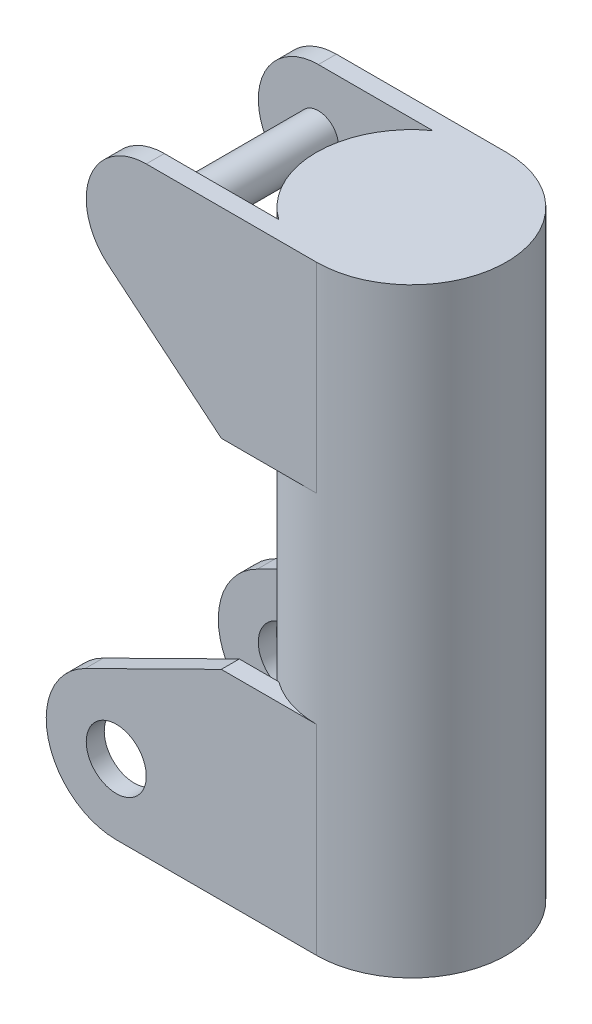
ISO-10303-21;
HEADER;
FILE_DESCRIPTION(('STEP AP214'),'2;1');
FILE_NAME('part.step','',(''),(''),'','','');
FILE_SCHEMA(('AUTOMOTIVE_DESIGN { 1 0 10303 214 1 1 1 1 }'));
ENDSEC;
DATA;
#1=APPLICATION_CONTEXT('core data for automotive mechanical design processes');
#2=APPLICATION_PROTOCOL_DEFINITION('international standard','automotive_design',2000,#1);
#3=PRODUCT_CONTEXT('',#1,'mechanical');
#4=PRODUCT('Part','Part','',(#3));
#5=PRODUCT_RELATED_PRODUCT_CATEGORY('part','',(#4));
#6=PRODUCT_DEFINITION_FORMATION('','',#4);
#7=PRODUCT_DEFINITION_CONTEXT('part definition',#1,'design');
#8=PRODUCT_DEFINITION('design','',#6,#7);
#9=PRODUCT_DEFINITION_SHAPE('','',#8);
#10=(LENGTH_UNIT() NAMED_UNIT(*) SI_UNIT(.MILLI.,.METRE.));
#11=(NAMED_UNIT(*) PLANE_ANGLE_UNIT() SI_UNIT($,.RADIAN.));
#12=(NAMED_UNIT(*) SI_UNIT($,.STERADIAN.) SOLID_ANGLE_UNIT());
#13=UNCERTAINTY_MEASURE_WITH_UNIT(LENGTH_MEASURE(1.E-05),#10,'distance_accuracy_value','');
#14=(GEOMETRIC_REPRESENTATION_CONTEXT(3) GLOBAL_UNCERTAINTY_ASSIGNED_CONTEXT((#13)) GLOBAL_UNIT_ASSIGNED_CONTEXT((#10,
#11,#12)) REPRESENTATION_CONTEXT('',''));
#15=CARTESIAN_POINT('',(0.,0.,0.));
#16=DIRECTION('',(0.,0.,1.));
#17=DIRECTION('',(1.,0.,0.));
#18=AXIS2_PLACEMENT_3D('',#15,#16,#17);
#19=CARTESIAN_POINT('',(0.,600.,0.));
#20=DIRECTION('',(0.,-1.,0.));
#21=DIRECTION('',(0.,0.,-1.));
#22=AXIS2_PLACEMENT_3D('',#19,#20,#21);
#23=CYLINDRICAL_SURFACE('',#22,95.);
#24=DIRECTION('',(0.,-1.,0.));
#25=VECTOR('',#24,1.);
#26=CARTESIAN_POINT('',(-55.6417109729742,600.,77.));
#27=LINE('',#26,#25);
#28=CARTESIAN_POINT('',(-55.6417109729742,200.,77.));
#29=VERTEX_POINT('',#28);
#30=CARTESIAN_POINT('',(-55.6417109729742,0.,77.));
#31=VERTEX_POINT('',#30);
#32=EDGE_CURVE('E341',#29,#31,#27,.T.);
#33=ORIENTED_EDGE('',*,*,#32,.F.);
#34=CARTESIAN_POINT('',(0.,200.,0.));
#35=DIRECTION('',(0.,-1.,0.));
#36=DIRECTION('',(0.,0.,-1.));
#37=AXIS2_PLACEMENT_3D('',#34,#35,#36);
#38=CIRCLE('',#37,95.);
#39=CARTESIAN_POINT('',(0.,200.,95.));
#40=VERTEX_POINT('',#39);
#41=EDGE_CURVE('E344',#40,#29,#38,.T.);
#42=ORIENTED_EDGE('',*,*,#41,.F.);
#43=DIRECTION('',(0.,-1.,0.));
#44=VECTOR('',#43,1.);
#45=CARTESIAN_POINT('',(0.,200.,95.));
#46=LINE('',#45,#44);
#47=CARTESIAN_POINT('',(0.,0.,95.));
#48=VERTEX_POINT('',#47);
#49=EDGE_CURVE('E297',#40,#48,#46,.T.);
#50=ORIENTED_EDGE('',*,*,#49,.T.);
#51=CARTESIAN_POINT('',(0.,0.,0.));
#52=DIRECTION('',(0.,1.,0.));
#53=DIRECTION('',(0.,0.,1.));
#54=AXIS2_PLACEMENT_3D('',#51,#52,#53);
#55=CIRCLE('',#54,95.);
#56=CARTESIAN_POINT('',(0.,0.,-95.));
#57=VERTEX_POINT('',#56);
#58=EDGE_CURVE('E452',#48,#57,#55,.T.);
#59=ORIENTED_EDGE('',*,*,#58,.T.);
#60=DIRECTION('',(0.,-1.,0.));
#61=VECTOR('',#60,1.);
#62=CARTESIAN_POINT('',(0.,200.,-95.));
#63=LINE('',#62,#61);
#64=CARTESIAN_POINT('',(0.,200.,-95.));
#65=VERTEX_POINT('',#64);
#66=EDGE_CURVE('E401',#65,#57,#63,.T.);
#67=ORIENTED_EDGE('',*,*,#66,.F.);
#68=CARTESIAN_POINT('',(0.,200.,0.));
#69=DIRECTION('',(0.,1.,0.));
#70=DIRECTION('',(0.,0.,1.));
#71=AXIS2_PLACEMENT_3D('',#68,#69,#70);
#72=CIRCLE('',#71,95.);
#73=CARTESIAN_POINT('',(-55.6417109729742,200.,-77.));
#74=VERTEX_POINT('',#73);
#75=EDGE_CURVE('E450',#65,#74,#72,.T.);
#76=ORIENTED_EDGE('',*,*,#75,.T.);
#77=DIRECTION('',(0.,-1.,0.));
#78=VECTOR('',#77,1.);
#79=CARTESIAN_POINT('',(-55.6417109729742,600.,-77.));
#80=LINE('',#79,#78);
#81=CARTESIAN_POINT('',(-55.6417109729742,0.,-77.));
#82=VERTEX_POINT('',#81);
#83=EDGE_CURVE('E445',#82,#74,#80,.F.);
#84=ORIENTED_EDGE('',*,*,#83,.F.);
#85=EDGE_CURVE('E456',#82,#31,#55,.T.);
#86=ORIENTED_EDGE('',*,*,#85,.T.);
#87=EDGE_LOOP('',(#33,#42,#50,#59,#67,#76,#84,#86));
#88=FACE_BOUND('',#87,.T.);
#89=DIRECTION('',(0.,-1.,0.));
#90=VECTOR('',#89,1.);
#91=CARTESIAN_POINT('',(-55.6417109729742,600.,77.));
#92=LINE('',#91,#90);
#93=CARTESIAN_POINT('',(-55.6417109729742,600.,77.));
#94=VERTEX_POINT('',#93);
#95=CARTESIAN_POINT('',(-55.6417109729742,400.,77.));
#96=VERTEX_POINT('',#95);
#97=EDGE_CURVE('E286',#94,#96,#92,.T.);
#98=ORIENTED_EDGE('',*,*,#97,.F.);
#99=CARTESIAN_POINT('',(0.,600.,0.));
#100=DIRECTION('',(0.,1.,0.));
#101=DIRECTION('',(0.,0.,1.));
#102=AXIS2_PLACEMENT_3D('',#99,#100,#101);
#103=CIRCLE('',#102,95.);
#104=CARTESIAN_POINT('',(-55.6417109729742,600.,-77.));
#105=VERTEX_POINT('',#104);
#106=EDGE_CURVE('E257',#105,#94,#103,.T.);
#107=ORIENTED_EDGE('',*,*,#106,.F.);
#108=DIRECTION('',(0.,-1.,0.));
#109=VECTOR('',#108,1.);
#110=CARTESIAN_POINT('',(-55.6417109729742,600.,-77.));
#111=LINE('',#110,#109);
#112=CARTESIAN_POINT('',(-55.6417109729742,400.,-77.));
#113=VERTEX_POINT('',#112);
#114=EDGE_CURVE('E389',#113,#105,#111,.F.);
#115=ORIENTED_EDGE('',*,*,#114,.F.);
#116=CARTESIAN_POINT('',(0.,400.,0.));
#117=DIRECTION('',(0.,-1.,0.));
#118=DIRECTION('',(1.,0.,0.));
#119=AXIS2_PLACEMENT_3D('',#116,#117,#118);
#120=CIRCLE('',#119,95.);
#121=CARTESIAN_POINT('',(0.,400.,-95.));
#122=VERTEX_POINT('',#121);
#123=EDGE_CURVE('E395',#113,#122,#120,.T.);
#124=ORIENTED_EDGE('',*,*,#123,.T.);
#125=DIRECTION('',(0.,-1.,0.));
#126=VECTOR('',#125,1.);
#127=CARTESIAN_POINT('',(0.,400.,-95.));
#128=LINE('',#127,#126);
#129=CARTESIAN_POINT('',(0.,600.,-95.));
#130=VERTEX_POINT('',#129);
#131=EDGE_CURVE('E371',#130,#122,#128,.T.);
#132=ORIENTED_EDGE('',*,*,#131,.F.);
#133=CARTESIAN_POINT('',(0.,600.,95.));
#134=VERTEX_POINT('',#133);
#135=EDGE_CURVE('E455',#134,#130,#103,.T.);
#136=ORIENTED_EDGE('',*,*,#135,.F.);
#137=DIRECTION('',(0.,-1.,0.));
#138=VECTOR('',#137,1.);
#139=CARTESIAN_POINT('',(0.,400.,95.));
#140=LINE('',#139,#138);
#141=CARTESIAN_POINT('',(0.,400.,95.));
#142=VERTEX_POINT('',#141);
#143=EDGE_CURVE('E504',#134,#142,#140,.T.);
#144=ORIENTED_EDGE('',*,*,#143,.T.);
#145=CARTESIAN_POINT('',(0.,400.,0.));
#146=DIRECTION('',(0.,1.,0.));
#147=DIRECTION('',(-1.,0.,0.));
#148=AXIS2_PLACEMENT_3D('',#145,#146,#147);
#149=CIRCLE('',#148,95.);
#150=EDGE_CURVE('E291',#96,#142,#149,.T.);
#151=ORIENTED_EDGE('',*,*,#150,.F.);
#152=EDGE_LOOP('',(#98,#107,#115,#124,#132,#136,#144,#151));
#153=FACE_BOUND('',#152,.T.);
#154=ADVANCED_FACE('F38',(#88,#153),#23,.T.);
#155=CARTESIAN_POINT('',(0.,600.,0.));
#156=DIRECTION('',(0.,1.,0.));
#157=DIRECTION('',(0.,0.,1.));
#158=AXIS2_PLACEMENT_3D('',#155,#156,#157);
#159=PLANE('',#158);
#160=ORIENTED_EDGE('',*,*,#106,.T.);
#161=DIRECTION('',(1.,0.,0.));
#162=VECTOR('',#161,1.);
#163=CARTESIAN_POINT('',(0.,600.,77.));
#164=LINE('',#163,#162);
#165=CARTESIAN_POINT('',(-170.,600.,77.));
#166=VERTEX_POINT('',#165);
#167=EDGE_CURVE('E250',#166,#94,#164,.T.);
#168=ORIENTED_EDGE('',*,*,#167,.F.);
#169=DIRECTION('',(0.,0.,1.));
#170=VECTOR('',#169,1.);
#171=CARTESIAN_POINT('',(-170.,600.,77.));
#172=LINE('',#171,#170);
#173=CARTESIAN_POINT('',(-170.,600.,95.));
#174=VERTEX_POINT('',#173);
#175=EDGE_CURVE('E254',#166,#174,#172,.T.);
#176=ORIENTED_EDGE('',*,*,#175,.T.);
#177=DIRECTION('',(1.,0.,0.));
#178=VECTOR('',#177,1.);
#179=CARTESIAN_POINT('',(-95.,600.,95.));
#180=LINE('',#179,#178);
#181=EDGE_CURVE('E507',#174,#134,#180,.T.);
#182=ORIENTED_EDGE('',*,*,#181,.T.);
#183=ORIENTED_EDGE('',*,*,#135,.T.);
#184=DIRECTION('',(1.,0.,0.));
#185=VECTOR('',#184,1.);
#186=CARTESIAN_POINT('',(0.,600.,-95.));
#187=LINE('',#186,#185);
#188=CARTESIAN_POINT('',(-170.,600.,-95.));
#189=VERTEX_POINT('',#188);
#190=EDGE_CURVE('E358',#189,#130,#187,.T.);
#191=ORIENTED_EDGE('',*,*,#190,.F.);
#192=DIRECTION('',(0.,0.,-1.));
#193=VECTOR('',#192,1.);
#194=CARTESIAN_POINT('',(-170.,600.,-77.));
#195=LINE('',#194,#193);
#196=CARTESIAN_POINT('',(-170.,600.,-77.));
#197=VERTEX_POINT('',#196);
#198=EDGE_CURVE('E347',#197,#189,#195,.T.);
#199=ORIENTED_EDGE('',*,*,#198,.F.);
#200=DIRECTION('',(1.,0.,0.));
#201=VECTOR('',#200,1.);
#202=CARTESIAN_POINT('',(-95.,600.,-77.));
#203=LINE('',#202,#201);
#204=EDGE_CURVE('E351',#197,#105,#203,.T.);
#205=ORIENTED_EDGE('',*,*,#204,.T.);
#206=EDGE_LOOP('',(#160,#168,#176,#182,#183,#191,#199,#205));
#207=FACE_BOUND('',#206,.T.);
#208=ADVANCED_FACE('F252',(#207),#159,.T.);
#209=CARTESIAN_POINT('',(0.,0.,0.));
#210=DIRECTION('',(0.,1.,0.));
#211=DIRECTION('',(0.,0.,1.));
#212=AXIS2_PLACEMENT_3D('',#209,#210,#211);
#213=PLANE('',#212);
#214=ORIENTED_EDGE('',*,*,#58,.F.);
#215=DIRECTION('',(-1.,0.,0.));
#216=VECTOR('',#215,1.);
#217=CARTESIAN_POINT('',(0.,0.,95.));
#218=LINE('',#217,#216);
#219=CARTESIAN_POINT('',(-200.,0.,95.));
#220=VERTEX_POINT('',#219);
#221=EDGE_CURVE('E304',#48,#220,#218,.T.);
#222=ORIENTED_EDGE('',*,*,#221,.T.);
#223=DIRECTION('',(0.,0.,1.));
#224=VECTOR('',#223,1.);
#225=CARTESIAN_POINT('',(-200.,0.,77.));
#226=LINE('',#225,#224);
#227=CARTESIAN_POINT('',(-200.,0.,77.));
#228=VERTEX_POINT('',#227);
#229=EDGE_CURVE('E324',#228,#220,#226,.T.);
#230=ORIENTED_EDGE('',*,*,#229,.F.);
#231=DIRECTION('',(-1.,0.,0.));
#232=VECTOR('',#231,1.);
#233=CARTESIAN_POINT('',(-95.,0.,77.));
#234=LINE('',#233,#232);
#235=EDGE_CURVE('E312',#31,#228,#234,.T.);
#236=ORIENTED_EDGE('',*,*,#235,.F.);
#237=ORIENTED_EDGE('',*,*,#85,.F.);
#238=DIRECTION('',(-1.,0.,0.));
#239=VECTOR('',#238,1.);
#240=CARTESIAN_POINT('',(0.,0.,-77.));
#241=LINE('',#240,#239);
#242=CARTESIAN_POINT('',(-200.,0.,-77.));
#243=VERTEX_POINT('',#242);
#244=EDGE_CURVE('E407',#82,#243,#241,.T.);
#245=ORIENTED_EDGE('',*,*,#244,.T.);
#246=DIRECTION('',(0.,0.,-1.));
#247=VECTOR('',#246,1.);
#248=CARTESIAN_POINT('',(-200.,0.,-77.));
#249=LINE('',#248,#247);
#250=CARTESIAN_POINT('',(-200.,0.,-95.));
#251=VERTEX_POINT('',#250);
#252=EDGE_CURVE('E420',#243,#251,#249,.T.);
#253=ORIENTED_EDGE('',*,*,#252,.T.);
#254=DIRECTION('',(-1.,0.,0.));
#255=VECTOR('',#254,1.);
#256=CARTESIAN_POINT('',(-95.,0.,-95.));
#257=LINE('',#256,#255);
#258=EDGE_CURVE('E423',#57,#251,#257,.T.);
#259=ORIENTED_EDGE('',*,*,#258,.F.);
#260=EDGE_LOOP('',(#214,#222,#230,#236,#237,#245,#253,#259));
#261=FACE_BOUND('',#260,.T.);
#262=ADVANCED_FACE('F558',(#261),#213,.F.);
#263=CARTESIAN_POINT('',(-200.,70.,-77.));
#264=DIRECTION('',(0.,0.,-1.));
#265=DIRECTION('',(-1.,0.,0.));
#266=AXIS2_PLACEMENT_3D('',#263,#264,#265);
#267=PLANE('',#266);
#268=CARTESIAN_POINT('',(-200.,70.,-77.));
#269=DIRECTION('',(0.,0.,-1.));
#270=DIRECTION('',(-1.,0.,0.));
#271=AXIS2_PLACEMENT_3D('',#268,#269,#270);
#272=CIRCLE('',#271,30.);
#273=CARTESIAN_POINT('',(-230.,70.,-77.));
#274=VERTEX_POINT('',#273);
#275=EDGE_CURVE('E398',#274,#274,#272,.T.);
#276=ORIENTED_EDGE('',*,*,#275,.T.);
#277=EDGE_LOOP('',(#276));
#278=FACE_BOUND('',#277,.T.);
#279=ORIENTED_EDGE('',*,*,#244,.F.);
#280=ORIENTED_EDGE('',*,*,#83,.T.);
#281=DIRECTION('',(1.,0.,0.));
#282=VECTOR('',#281,1.);
#283=CARTESIAN_POINT('',(-95.,200.,-77.));
#284=LINE('',#283,#282);
#285=CARTESIAN_POINT('',(-95.,200.,-77.));
#286=VERTEX_POINT('',#285);
#287=EDGE_CURVE('E417',#286,#74,#284,.T.);
#288=ORIENTED_EDGE('',*,*,#287,.F.);
#289=DIRECTION('',(0.896425799490356,0.44319384698806,0.));
#290=VECTOR('',#289,1.);
#291=CARTESIAN_POINT('',(-231.023569289164,132.749805964325,-77.));
#292=LINE('',#291,#290);
#293=CARTESIAN_POINT('',(-231.023569289164,132.749805964325,-77.));
#294=VERTEX_POINT('',#293);
#295=EDGE_CURVE('E413',#294,#286,#292,.T.);
#296=ORIENTED_EDGE('',*,*,#295,.F.);
#297=CARTESIAN_POINT('',(-200.,70.,-77.));
#298=DIRECTION('',(0.,0.,-1.));
#299=DIRECTION('',(-1.,0.,0.));
#300=AXIS2_PLACEMENT_3D('',#297,#298,#299);
#301=CIRCLE('',#300,70.);
#302=EDGE_CURVE('E410',#243,#294,#301,.T.);
#303=ORIENTED_EDGE('',*,*,#302,.F.);
#304=EDGE_LOOP('',(#279,#280,#288,#296,#303));
#305=FACE_BOUND('',#304,.T.);
#306=ADVANCED_FACE('F659',(#278,#305),#267,.F.);
#307=CARTESIAN_POINT('',(-95.,200.,-77.));
#308=DIRECTION('',(0.,1.,0.));
#309=DIRECTION('',(0.,0.,1.));
#310=AXIS2_PLACEMENT_3D('',#307,#308,#309);
#311=PLANE('',#310);
#312=ORIENTED_EDGE('',*,*,#75,.F.);
#313=DIRECTION('',(1.,0.,0.));
#314=VECTOR('',#313,1.);
#315=CARTESIAN_POINT('',(-95.,200.,-95.));
#316=LINE('',#315,#314);
#317=CARTESIAN_POINT('',(-95.,200.,-95.));
#318=VERTEX_POINT('',#317);
#319=EDGE_CURVE('E408',#318,#65,#316,.T.);
#320=ORIENTED_EDGE('',*,*,#319,.F.);
#321=DIRECTION('',(0.,0.,-1.));
#322=VECTOR('',#321,1.);
#323=CARTESIAN_POINT('',(-95.,200.,-77.));
#324=LINE('',#323,#322);
#325=EDGE_CURVE('E438',#286,#318,#324,.T.);
#326=ORIENTED_EDGE('',*,*,#325,.F.);
#327=ORIENTED_EDGE('',*,*,#287,.T.);
#328=EDGE_LOOP('',(#312,#320,#326,#327));
#329=FACE_BOUND('',#328,.T.);
#330=ADVANCED_FACE('F654',(#329),#311,.T.);
#331=CARTESIAN_POINT('',(-231.023569289164,132.749805964325,-77.));
#332=DIRECTION('',(-0.44319384698806,0.896425799490356,0.));
#333=DIRECTION('',(-0.896425799490356,-0.44319384698806,0.));
#334=AXIS2_PLACEMENT_3D('',#331,#332,#333);
#335=PLANE('',#334);
#336=DIRECTION('',(0.896425799490356,0.44319384698806,0.));
#337=VECTOR('',#336,1.);
#338=CARTESIAN_POINT('',(-231.023569289164,132.749805964325,-95.));
#339=LINE('',#338,#337);
#340=CARTESIAN_POINT('',(-231.023569289164,132.749805964325,-95.));
#341=VERTEX_POINT('',#340);
#342=EDGE_CURVE('E429',#341,#318,#339,.T.);
#343=ORIENTED_EDGE('',*,*,#342,.F.);
#344=DIRECTION('',(0.,0.,-1.));
#345=VECTOR('',#344,1.);
#346=CARTESIAN_POINT('',(-231.023569289164,132.749805964325,-77.));
#347=LINE('',#346,#345);
#348=EDGE_CURVE('E440',#294,#341,#347,.T.);
#349=ORIENTED_EDGE('',*,*,#348,.F.);
#350=ORIENTED_EDGE('',*,*,#295,.T.);
#351=ORIENTED_EDGE('',*,*,#325,.T.);
#352=EDGE_LOOP('',(#343,#349,#350,#351));
#353=FACE_BOUND('',#352,.T.);
#354=ADVANCED_FACE('F750',(#353),#335,.T.);
#355=CARTESIAN_POINT('',(-200.,70.,-77.));
#356=DIRECTION('',(0.,0.,-1.));
#357=DIRECTION('',(-1.,0.,0.));
#358=AXIS2_PLACEMENT_3D('',#355,#356,#357);
#359=CYLINDRICAL_SURFACE('',#358,70.);
#360=CARTESIAN_POINT('',(-200.,70.,-95.));
#361=DIRECTION('',(0.,0.,-1.));
#362=DIRECTION('',(-1.,0.,0.));
#363=AXIS2_PLACEMENT_3D('',#360,#361,#362);
#364=CIRCLE('',#363,70.);
#365=EDGE_CURVE('E426',#251,#341,#364,.T.);
#366=ORIENTED_EDGE('',*,*,#365,.F.);
#367=ORIENTED_EDGE('',*,*,#252,.F.);
#368=ORIENTED_EDGE('',*,*,#302,.T.);
#369=ORIENTED_EDGE('',*,*,#348,.T.);
#370=EDGE_LOOP('',(#366,#367,#368,#369));
#371=FACE_BOUND('',#370,.T.);
#372=ADVANCED_FACE('F756',(#371),#359,.T.);
#373=CARTESIAN_POINT('',(-200.,70.,-95.));
#374=DIRECTION('',(0.,0.,-1.));
#375=DIRECTION('',(-1.,0.,0.));
#376=AXIS2_PLACEMENT_3D('',#373,#374,#375);
#377=PLANE('',#376);
#378=CARTESIAN_POINT('',(-200.,70.,-95.));
#379=DIRECTION('',(0.,0.,-1.));
#380=DIRECTION('',(-1.,0.,0.));
#381=AXIS2_PLACEMENT_3D('',#378,#379,#380);
#382=CIRCLE('',#381,30.);
#383=CARTESIAN_POINT('',(-230.,70.,-95.));
#384=VERTEX_POINT('',#383);
#385=EDGE_CURVE('E397',#384,#384,#382,.T.);
#386=ORIENTED_EDGE('',*,*,#385,.F.);
#387=EDGE_LOOP('',(#386));
#388=FACE_BOUND('',#387,.T.);
#389=ORIENTED_EDGE('',*,*,#66,.T.);
#390=ORIENTED_EDGE('',*,*,#258,.T.);
#391=ORIENTED_EDGE('',*,*,#365,.T.);
#392=ORIENTED_EDGE('',*,*,#342,.T.);
#393=ORIENTED_EDGE('',*,*,#319,.T.);
#394=EDGE_LOOP('',(#389,#390,#391,#392,#393));
#395=FACE_BOUND('',#394,.T.);
#396=ADVANCED_FACE('F650',(#388,#395),#377,.T.);
#397=CARTESIAN_POINT('',(-200.,70.,-77.));
#398=DIRECTION('',(0.,0.,-1.));
#399=DIRECTION('',(-1.,0.,0.));
#400=AXIS2_PLACEMENT_3D('',#397,#398,#399);
#401=CYLINDRICAL_SURFACE('',#400,30.);
#402=ORIENTED_EDGE('',*,*,#275,.F.);
#403=EDGE_LOOP('',(#402));
#404=FACE_BOUND('',#403,.T.);
#405=ORIENTED_EDGE('',*,*,#385,.T.);
#406=EDGE_LOOP('',(#405));
#407=FACE_BOUND('',#406,.T.);
#408=ADVANCED_FACE('F689',(#404,#407),#401,.F.);
#409=CARTESIAN_POINT('',(-170.,540.,-77.));
#410=DIRECTION('',(0.,0.,-1.));
#411=DIRECTION('',(-1.,0.,0.));
#412=AXIS2_PLACEMENT_3D('',#409,#410,#411);
#413=PLANE('',#412);
#414=CARTESIAN_POINT('',(-170.,540.,-77.));
#415=DIRECTION('',(0.,0.,-1.));
#416=DIRECTION('',(-1.,0.,0.));
#417=AXIS2_PLACEMENT_3D('',#414,#415,#416);
#418=CIRCLE('',#417,20.);
#419=CARTESIAN_POINT('',(-190.,540.,-77.));
#420=VERTEX_POINT('',#419);
#421=EDGE_CURVE('E11',#420,#420,#418,.F.);
#422=ORIENTED_EDGE('',*,*,#421,.F.);
#423=EDGE_LOOP('',(#422));
#424=FACE_BOUND('',#423,.T.);
#425=DIRECTION('',(-1.,0.,0.));
#426=VECTOR('',#425,1.);
#427=CARTESIAN_POINT('',(-95.,400.,-77.));
#428=LINE('',#427,#426);
#429=CARTESIAN_POINT('',(-95.,400.,-77.));
#430=VERTEX_POINT('',#429);
#431=EDGE_CURVE('E382',#113,#430,#428,.T.);
#432=ORIENTED_EDGE('',*,*,#431,.F.);
#433=ORIENTED_EDGE('',*,*,#114,.T.);
#434=ORIENTED_EDGE('',*,*,#204,.F.);
#435=CARTESIAN_POINT('',(-170.,540.,-77.));
#436=DIRECTION('',(0.,0.,-1.));
#437=DIRECTION('',(-1.,0.,0.));
#438=AXIS2_PLACEMENT_3D('',#435,#436,#437);
#439=CIRCLE('',#438,60.);
#440=CARTESIAN_POINT('',(-208.265889326764,493.786130717805,-77.));
#441=VERTEX_POINT('',#440);
#442=EDGE_CURVE('E376',#441,#197,#439,.T.);
#443=ORIENTED_EDGE('',*,*,#442,.F.);
#444=DIRECTION('',(-0.770231154703253,0.637764822112739,0.));
#445=VECTOR('',#444,1.);
#446=CARTESIAN_POINT('',(-208.265889326764,493.786130717805,-77.));
#447=LINE('',#446,#445);
#448=EDGE_CURVE('E379',#430,#441,#447,.T.);
#449=ORIENTED_EDGE('',*,*,#448,.F.);
#450=EDGE_LOOP('',(#432,#433,#434,#443,#449));
#451=FACE_BOUND('',#450,.T.);
#452=ADVANCED_FACE('F536',(#424,#451),#413,.F.);
#453=CARTESIAN_POINT('',(-170.,540.,-77.));
#454=DIRECTION('',(0.,0.,-1.));
#455=DIRECTION('',(-1.,0.,0.));
#456=AXIS2_PLACEMENT_3D('',#453,#454,#455);
#457=CYLINDRICAL_SURFACE('',#456,60.);
#458=CARTESIAN_POINT('',(-170.,540.,-95.));
#459=DIRECTION('',(0.,0.,-1.));
#460=DIRECTION('',(-1.,0.,0.));
#461=AXIS2_PLACEMENT_3D('',#458,#459,#460);
#462=CIRCLE('',#461,60.);
#463=CARTESIAN_POINT('',(-208.265889326764,493.786130717805,-95.));
#464=VERTEX_POINT('',#463);
#465=EDGE_CURVE('E361',#464,#189,#462,.T.);
#466=ORIENTED_EDGE('',*,*,#465,.F.);
#467=DIRECTION('',(0.,0.,-1.));
#468=VECTOR('',#467,1.);
#469=CARTESIAN_POINT('',(-208.265889326764,493.786130717805,-77.));
#470=LINE('',#469,#468);
#471=EDGE_CURVE('E354',#441,#464,#470,.T.);
#472=ORIENTED_EDGE('',*,*,#471,.F.);
#473=ORIENTED_EDGE('',*,*,#442,.T.);
#474=ORIENTED_EDGE('',*,*,#198,.T.);
#475=EDGE_LOOP('',(#466,#472,#473,#474));
#476=FACE_BOUND('',#475,.T.);
#477=ADVANCED_FACE('F531',(#476),#457,.T.);
#478=CARTESIAN_POINT('',(-208.265889326764,493.786130717805,-77.));
#479=DIRECTION('',(-0.637764822112739,-0.770231154703253,0.));
#480=DIRECTION('',(0.770231154703253,-0.637764822112739,0.));
#481=AXIS2_PLACEMENT_3D('',#478,#479,#480);
#482=PLANE('',#481);
#483=DIRECTION('',(-0.770231154703253,0.637764822112739,0.));
#484=VECTOR('',#483,1.);
#485=CARTESIAN_POINT('',(-208.265889326764,493.786130717805,-95.));
#486=LINE('',#485,#484);
#487=CARTESIAN_POINT('',(-95.,400.,-95.));
#488=VERTEX_POINT('',#487);
#489=EDGE_CURVE('E365',#488,#464,#486,.T.);
#490=ORIENTED_EDGE('',*,*,#489,.F.);
#491=DIRECTION('',(0.,0.,-1.));
#492=VECTOR('',#491,1.);
#493=CARTESIAN_POINT('',(-95.,400.,-77.));
#494=LINE('',#493,#492);
#495=EDGE_CURVE('E352',#430,#488,#494,.T.);
#496=ORIENTED_EDGE('',*,*,#495,.F.);
#497=ORIENTED_EDGE('',*,*,#448,.T.);
#498=ORIENTED_EDGE('',*,*,#471,.T.);
#499=EDGE_LOOP('',(#490,#496,#497,#498));
#500=FACE_BOUND('',#499,.T.);
#501=ADVANCED_FACE('F542',(#500),#482,.T.);
#502=CARTESIAN_POINT('',(-95.,400.,-77.));
#503=DIRECTION('',(0.,-1.,0.));
#504=DIRECTION('',(1.,0.,0.));
#505=AXIS2_PLACEMENT_3D('',#502,#503,#504);
#506=PLANE('',#505);
#507=ORIENTED_EDGE('',*,*,#123,.F.);
#508=ORIENTED_EDGE('',*,*,#431,.T.);
#509=ORIENTED_EDGE('',*,*,#495,.T.);
#510=DIRECTION('',(-1.,0.,0.));
#511=VECTOR('',#510,1.);
#512=CARTESIAN_POINT('',(-95.,400.,-95.));
#513=LINE('',#512,#511);
#514=EDGE_CURVE('E368',#122,#488,#513,.T.);
#515=ORIENTED_EDGE('',*,*,#514,.F.);
#516=EDGE_LOOP('',(#507,#508,#509,#515));
#517=FACE_BOUND('',#516,.T.);
#518=ADVANCED_FACE('F539',(#517),#506,.T.);
#519=CARTESIAN_POINT('',(-170.,540.,-95.));
#520=DIRECTION('',(0.,0.,-1.));
#521=DIRECTION('',(-1.,0.,0.));
#522=AXIS2_PLACEMENT_3D('',#519,#520,#521);
#523=PLANE('',#522);
#524=ORIENTED_EDGE('',*,*,#131,.T.);
#525=ORIENTED_EDGE('',*,*,#514,.T.);
#526=ORIENTED_EDGE('',*,*,#489,.T.);
#527=ORIENTED_EDGE('',*,*,#465,.T.);
#528=ORIENTED_EDGE('',*,*,#190,.T.);
#529=EDGE_LOOP('',(#524,#525,#526,#527,#528));
#530=FACE_BOUND('',#529,.T.);
#531=ADVANCED_FACE('F527',(#530),#523,.T.);
#532=CARTESIAN_POINT('',(-200.,70.,77.));
#533=DIRECTION('',(0.,0.,1.));
#534=DIRECTION('',(-1.,0.,0.));
#535=AXIS2_PLACEMENT_3D('',#532,#533,#534);
#536=PLANE('',#535);
#537=CARTESIAN_POINT('',(-200.,70.,77.));
#538=DIRECTION('',(0.,0.,-1.));
#539=DIRECTION('',(-1.,0.,0.));
#540=AXIS2_PLACEMENT_3D('',#537,#538,#539);
#541=CIRCLE('',#540,30.);
#542=CARTESIAN_POINT('',(-230.,70.,77.));
#543=VERTEX_POINT('',#542);
#544=EDGE_CURVE('E294',#543,#543,#541,.T.);
#545=ORIENTED_EDGE('',*,*,#544,.F.);
#546=EDGE_LOOP('',(#545));
#547=FACE_BOUND('',#546,.T.);
#548=DIRECTION('',(1.,0.,0.));
#549=VECTOR('',#548,1.);
#550=CARTESIAN_POINT('',(-95.,200.,77.));
#551=LINE('',#550,#549);
#552=CARTESIAN_POINT('',(-95.,200.,77.));
#553=VERTEX_POINT('',#552);
#554=EDGE_CURVE('E305',#553,#29,#551,.T.);
#555=ORIENTED_EDGE('',*,*,#554,.T.);
#556=ORIENTED_EDGE('',*,*,#32,.T.);
#557=ORIENTED_EDGE('',*,*,#235,.T.);
#558=CARTESIAN_POINT('',(-200.,70.,77.));
#559=DIRECTION('',(0.,0.,-1.));
#560=DIRECTION('',(-1.,0.,0.));
#561=AXIS2_PLACEMENT_3D('',#558,#559,#560);
#562=CIRCLE('',#561,70.);
#563=CARTESIAN_POINT('',(-231.023569289164,132.749805964325,77.));
#564=VERTEX_POINT('',#563);
#565=EDGE_CURVE('E310',#228,#564,#562,.T.);
#566=ORIENTED_EDGE('',*,*,#565,.T.);
#567=DIRECTION('',(0.896425799490356,0.44319384698806,0.));
#568=VECTOR('',#567,1.);
#569=CARTESIAN_POINT('',(-231.023569289164,132.749805964325,77.));
#570=LINE('',#569,#568);
#571=EDGE_CURVE('E308',#564,#553,#570,.T.);
#572=ORIENTED_EDGE('',*,*,#571,.T.);
#573=EDGE_LOOP('',(#555,#556,#557,#566,#572));
#574=FACE_BOUND('',#573,.T.);
#575=ADVANCED_FACE('F622',(#547,#574),#536,.F.);
#576=CARTESIAN_POINT('',(-200.,70.,95.));
#577=DIRECTION('',(0.,0.,1.));
#578=DIRECTION('',(-1.,0.,0.));
#579=AXIS2_PLACEMENT_3D('',#576,#577,#578);
#580=PLANE('',#579);
#581=ORIENTED_EDGE('',*,*,#49,.F.);
#582=DIRECTION('',(1.,0.,0.));
#583=VECTOR('',#582,1.);
#584=CARTESIAN_POINT('',(-95.,200.,95.));
#585=LINE('',#584,#583);
#586=CARTESIAN_POINT('',(-95.,200.,95.));
#587=VERTEX_POINT('',#586);
#588=EDGE_CURVE('E316',#587,#40,#585,.T.);
#589=ORIENTED_EDGE('',*,*,#588,.F.);
#590=DIRECTION('',(0.896425799490356,0.44319384698806,0.));
#591=VECTOR('',#590,1.);
#592=CARTESIAN_POINT('',(-231.023569289164,132.749805964325,95.));
#593=LINE('',#592,#591);
#594=CARTESIAN_POINT('',(-231.023569289164,132.749805964325,95.));
#595=VERTEX_POINT('',#594);
#596=EDGE_CURVE('E319',#595,#587,#593,.T.);
#597=ORIENTED_EDGE('',*,*,#596,.F.);
#598=CARTESIAN_POINT('',(-200.,70.,95.));
#599=DIRECTION('',(0.,0.,-1.));
#600=DIRECTION('',(-1.,0.,0.));
#601=AXIS2_PLACEMENT_3D('',#598,#599,#600);
#602=CIRCLE('',#601,70.);
#603=EDGE_CURVE('E321',#220,#595,#602,.T.);
#604=ORIENTED_EDGE('',*,*,#603,.F.);
#605=ORIENTED_EDGE('',*,*,#221,.F.);
#606=EDGE_LOOP('',(#581,#589,#597,#604,#605));
#607=FACE_BOUND('',#606,.T.);
#608=CARTESIAN_POINT('',(-200.,70.,95.));
#609=DIRECTION('',(0.,0.,-1.));
#610=DIRECTION('',(-1.,0.,0.));
#611=AXIS2_PLACEMENT_3D('',#608,#609,#610);
#612=CIRCLE('',#611,30.);
#613=CARTESIAN_POINT('',(-230.,70.,95.));
#614=VERTEX_POINT('',#613);
#615=EDGE_CURVE('E293',#614,#614,#612,.T.);
#616=ORIENTED_EDGE('',*,*,#615,.T.);
#617=EDGE_LOOP('',(#616));
#618=FACE_BOUND('',#617,.T.);
#619=ADVANCED_FACE('F640',(#607,#618),#580,.T.);
#620=CARTESIAN_POINT('',(-200.,70.,77.));
#621=DIRECTION('',(0.,0.,1.));
#622=DIRECTION('',(1.,0.,0.));
#623=AXIS2_PLACEMENT_3D('',#620,#621,#622);
#624=CYLINDRICAL_SURFACE('',#623,70.);
#625=ORIENTED_EDGE('',*,*,#603,.T.);
#626=DIRECTION('',(0.,0.,1.));
#627=VECTOR('',#626,1.);
#628=CARTESIAN_POINT('',(-231.023569289164,132.749805964325,77.));
#629=LINE('',#628,#627);
#630=EDGE_CURVE('E328',#564,#595,#629,.T.);
#631=ORIENTED_EDGE('',*,*,#630,.F.);
#632=ORIENTED_EDGE('',*,*,#565,.F.);
#633=ORIENTED_EDGE('',*,*,#229,.T.);
#634=EDGE_LOOP('',(#625,#631,#632,#633));
#635=FACE_BOUND('',#634,.T.);
#636=ADVANCED_FACE('F631',(#635),#624,.T.);
#637=CARTESIAN_POINT('',(-231.023569289164,132.749805964325,77.));
#638=DIRECTION('',(0.44319384698806,-0.896425799490356,0.));
#639=DIRECTION('',(0.896425799490356,0.44319384698806,0.));
#640=AXIS2_PLACEMENT_3D('',#637,#638,#639);
#641=PLANE('',#640);
#642=ORIENTED_EDGE('',*,*,#596,.T.);
#643=DIRECTION('',(0.,0.,1.));
#644=VECTOR('',#643,1.);
#645=CARTESIAN_POINT('',(-95.,200.,77.));
#646=LINE('',#645,#644);
#647=EDGE_CURVE('E331',#553,#587,#646,.T.);
#648=ORIENTED_EDGE('',*,*,#647,.F.);
#649=ORIENTED_EDGE('',*,*,#571,.F.);
#650=ORIENTED_EDGE('',*,*,#630,.T.);
#651=EDGE_LOOP('',(#642,#648,#649,#650));
#652=FACE_BOUND('',#651,.T.);
#653=ADVANCED_FACE('F626',(#652),#641,.F.);
#654=CARTESIAN_POINT('',(-95.,200.,77.));
#655=DIRECTION('',(0.,-1.,0.));
#656=DIRECTION('',(0.,0.,-1.));
#657=AXIS2_PLACEMENT_3D('',#654,#655,#656);
#658=PLANE('',#657);
#659=ORIENTED_EDGE('',*,*,#588,.T.);
#660=ORIENTED_EDGE('',*,*,#41,.T.);
#661=ORIENTED_EDGE('',*,*,#554,.F.);
#662=ORIENTED_EDGE('',*,*,#647,.T.);
#663=EDGE_LOOP('',(#659,#660,#661,#662));
#664=FACE_BOUND('',#663,.T.);
#665=ADVANCED_FACE('F604',(#664),#658,.F.);
#666=CARTESIAN_POINT('',(-200.,70.,77.));
#667=DIRECTION('',(0.,0.,1.));
#668=DIRECTION('',(1.,0.,0.));
#669=AXIS2_PLACEMENT_3D('',#666,#667,#668);
#670=CYLINDRICAL_SURFACE('',#669,30.);
#671=ORIENTED_EDGE('',*,*,#544,.T.);
#672=EDGE_LOOP('',(#671));
#673=FACE_BOUND('',#672,.T.);
#674=ORIENTED_EDGE('',*,*,#615,.F.);
#675=EDGE_LOOP('',(#674));
#676=FACE_BOUND('',#675,.T.);
#677=ADVANCED_FACE('F597',(#673,#676),#670,.F.);
#678=CARTESIAN_POINT('',(-170.,540.,77.));
#679=DIRECTION('',(0.,0.,1.));
#680=DIRECTION('',(-1.,0.,0.));
#681=AXIS2_PLACEMENT_3D('',#678,#679,#680);
#682=PLANE('',#681);
#683=CARTESIAN_POINT('',(-170.,540.,77.));
#684=DIRECTION('',(0.,0.,1.));
#685=DIRECTION('',(1.,0.,0.));
#686=AXIS2_PLACEMENT_3D('',#683,#684,#685);
#687=CIRCLE('',#686,20.);
#688=CARTESIAN_POINT('',(-150.,540.,77.));
#689=VERTEX_POINT('',#688);
#690=EDGE_CURVE('E48',#689,#689,#687,.F.);
#691=ORIENTED_EDGE('',*,*,#690,.F.);
#692=EDGE_LOOP('',(#691));
#693=FACE_BOUND('',#692,.T.);
#694=ORIENTED_EDGE('',*,*,#167,.T.);
#695=ORIENTED_EDGE('',*,*,#97,.T.);
#696=DIRECTION('',(-1.,0.,0.));
#697=VECTOR('',#696,1.);
#698=CARTESIAN_POINT('',(-95.,400.,77.));
#699=LINE('',#698,#697);
#700=CARTESIAN_POINT('',(-95.,400.,77.));
#701=VERTEX_POINT('',#700);
#702=EDGE_CURVE('E280',#96,#701,#699,.T.);
#703=ORIENTED_EDGE('',*,*,#702,.T.);
#704=DIRECTION('',(-0.770231154703253,0.637764822112739,0.));
#705=VECTOR('',#704,1.);
#706=CARTESIAN_POINT('',(-208.265889326764,493.786130717805,77.));
#707=LINE('',#706,#705);
#708=CARTESIAN_POINT('',(-208.265889326764,493.786130717805,77.));
#709=VERTEX_POINT('',#708);
#710=EDGE_CURVE('E266',#701,#709,#707,.T.);
#711=ORIENTED_EDGE('',*,*,#710,.T.);
#712=CARTESIAN_POINT('',(-170.,540.,77.));
#713=DIRECTION('',(0.,0.,-1.));
#714=DIRECTION('',(-1.,0.,0.));
#715=AXIS2_PLACEMENT_3D('',#712,#713,#714);
#716=CIRCLE('',#715,60.);
#717=EDGE_CURVE('E260',#709,#166,#716,.T.);
#718=ORIENTED_EDGE('',*,*,#717,.T.);
#719=EDGE_LOOP('',(#694,#695,#703,#711,#718));
#720=FACE_BOUND('',#719,.T.);
#721=ADVANCED_FACE('F264',(#693,#720),#682,.F.);
#722=CARTESIAN_POINT('',(-95.,400.,77.));
#723=DIRECTION('',(0.,1.,0.));
#724=DIRECTION('',(-1.,0.,0.));
#725=AXIS2_PLACEMENT_3D('',#722,#723,#724);
#726=PLANE('',#725);
#727=ORIENTED_EDGE('',*,*,#702,.F.);
#728=ORIENTED_EDGE('',*,*,#150,.T.);
#729=DIRECTION('',(-1.,0.,0.));
#730=VECTOR('',#729,1.);
#731=CARTESIAN_POINT('',(-95.,400.,95.));
#732=LINE('',#731,#730);
#733=CARTESIAN_POINT('',(-95.,400.,95.));
#734=VERTEX_POINT('',#733);
#735=EDGE_CURVE('E56',#142,#734,#732,.T.);
#736=ORIENTED_EDGE('',*,*,#735,.T.);
#737=DIRECTION('',(0.,0.,1.));
#738=VECTOR('',#737,1.);
#739=CARTESIAN_POINT('',(-95.,400.,77.));
#740=LINE('',#739,#738);
#741=EDGE_CURVE('E277',#701,#734,#740,.T.);
#742=ORIENTED_EDGE('',*,*,#741,.F.);
#743=EDGE_LOOP('',(#727,#728,#736,#742));
#744=FACE_BOUND('',#743,.T.);
#745=ADVANCED_FACE('F585',(#744),#726,.F.);
#746=CARTESIAN_POINT('',(-208.265889326764,493.786130717805,77.));
#747=DIRECTION('',(0.637764822112739,0.770231154703253,0.));
#748=DIRECTION('',(-0.770231154703253,0.637764822112739,0.));
#749=AXIS2_PLACEMENT_3D('',#746,#747,#748);
#750=PLANE('',#749);
#751=DIRECTION('',(-0.770231154703253,0.637764822112739,0.));
#752=VECTOR('',#751,1.);
#753=CARTESIAN_POINT('',(-208.265889326764,493.786130717805,95.));
#754=LINE('',#753,#752);
#755=CARTESIAN_POINT('',(-208.265889326764,493.786130717805,95.));
#756=VERTEX_POINT('',#755);
#757=EDGE_CURVE('E510',#734,#756,#754,.T.);
#758=ORIENTED_EDGE('',*,*,#757,.T.);
#759=DIRECTION('',(0.,0.,1.));
#760=VECTOR('',#759,1.);
#761=CARTESIAN_POINT('',(-208.265889326764,493.786130717805,77.));
#762=LINE('',#761,#760);
#763=EDGE_CURVE('E274',#709,#756,#762,.T.);
#764=ORIENTED_EDGE('',*,*,#763,.F.);
#765=ORIENTED_EDGE('',*,*,#710,.F.);
#766=ORIENTED_EDGE('',*,*,#741,.T.);
#767=EDGE_LOOP('',(#758,#764,#765,#766));
#768=FACE_BOUND('',#767,.T.);
#769=ADVANCED_FACE('F517',(#768),#750,.F.);
#770=CARTESIAN_POINT('',(-170.,540.,77.));
#771=DIRECTION('',(0.,0.,1.));
#772=DIRECTION('',(1.,0.,0.));
#773=AXIS2_PLACEMENT_3D('',#770,#771,#772);
#774=CYLINDRICAL_SURFACE('',#773,60.);
#775=CARTESIAN_POINT('',(-170.,540.,95.));
#776=DIRECTION('',(0.,0.,-1.));
#777=DIRECTION('',(-1.,0.,0.));
#778=AXIS2_PLACEMENT_3D('',#775,#776,#777);
#779=CIRCLE('',#778,60.);
#780=EDGE_CURVE('E273',#756,#174,#779,.T.);
#781=ORIENTED_EDGE('',*,*,#780,.T.);
#782=ORIENTED_EDGE('',*,*,#175,.F.);
#783=ORIENTED_EDGE('',*,*,#717,.F.);
#784=ORIENTED_EDGE('',*,*,#763,.T.);
#785=EDGE_LOOP('',(#781,#782,#783,#784));
#786=FACE_BOUND('',#785,.T.);
#787=ADVANCED_FACE('F271',(#786),#774,.T.);
#788=CARTESIAN_POINT('',(-170.,540.,95.));
#789=DIRECTION('',(0.,0.,1.));
#790=DIRECTION('',(-1.,0.,0.));
#791=AXIS2_PLACEMENT_3D('',#788,#789,#790);
#792=PLANE('',#791);
#793=ORIENTED_EDGE('',*,*,#143,.F.);
#794=ORIENTED_EDGE('',*,*,#181,.F.);
#795=ORIENTED_EDGE('',*,*,#780,.F.);
#796=ORIENTED_EDGE('',*,*,#757,.F.);
#797=ORIENTED_EDGE('',*,*,#735,.F.);
#798=EDGE_LOOP('',(#793,#794,#795,#796,#797));
#799=FACE_BOUND('',#798,.T.);
#800=ADVANCED_FACE('F520',(#799),#792,.T.);
#801=CARTESIAN_POINT('',(-170.,540.,95.));
#802=DIRECTION('',(0.,0.,-1.));
#803=DIRECTION('',(-1.,0.,0.));
#804=AXIS2_PLACEMENT_3D('',#801,#802,#803);
#805=CYLINDRICAL_SURFACE('',#804,20.);
#806=ORIENTED_EDGE('',*,*,#690,.T.);
#807=EDGE_LOOP('',(#806));
#808=FACE_BOUND('',#807,.T.);
#809=ORIENTED_EDGE('',*,*,#421,.T.);
#810=EDGE_LOOP('',(#809));
#811=FACE_BOUND('',#810,.T.);
#812=ADVANCED_FACE('F679',(#808,#811),#805,.T.);
#813=CLOSED_SHELL('',(#154,#208,#262,#306,#330,#354,#372,#396,#408,#452,#477,#501,#518,#531,
#575,#619,#636,#653,#665,#677,#721,#745,#769,#787,#800,#812));
#814=CARTESIAN_POINT('',(0.,600.,0.));
#815=DIRECTION('',(0.,-1.,0.));
#816=DIRECTION('',(0.,0.,-1.));
#817=AXIS2_PLACEMENT_3D('',#814,#815,#816);
#818=CYLINDRICAL_SURFACE('',#817,85.);
#819=CARTESIAN_POINT('',(0.,200.,0.));
#820=DIRECTION('',(0.,-1.,0.));
#821=DIRECTION('',(0.,0.,-1.));
#822=AXIS2_PLACEMENT_3D('',#819,#820,#821);
#823=CIRCLE('',#822,85.);
#824=CARTESIAN_POINT('',(0.,200.,85.));
#825=VERTEX_POINT('',#824);
#826=CARTESIAN_POINT('',(-36.,200.,77.));
#827=VERTEX_POINT('',#826);
#828=EDGE_CURVE('E488',#825,#827,#823,.T.);
#829=ORIENTED_EDGE('',*,*,#828,.T.);
#830=DIRECTION('',(0.,-1.,0.));
#831=VECTOR('',#830,1.);
#832=CARTESIAN_POINT('',(-36.,600.,77.));
#833=LINE('',#832,#831);
#834=CARTESIAN_POINT('',(-36.,10.,77.));
#835=VERTEX_POINT('',#834);
#836=EDGE_CURVE('E338',#827,#835,#833,.T.);
#837=ORIENTED_EDGE('',*,*,#836,.T.);
#838=CARTESIAN_POINT('',(0.,10.,0.));
#839=DIRECTION('',(0.,1.,0.));
#840=DIRECTION('',(0.,0.,1.));
#841=AXIS2_PLACEMENT_3D('',#838,#839,#840);
#842=CIRCLE('',#841,85.);
#843=CARTESIAN_POINT('',(-36.,10.,-77.));
#844=VERTEX_POINT('',#843);
#845=EDGE_CURVE('E463',#844,#835,#842,.T.);
#846=ORIENTED_EDGE('',*,*,#845,.F.);
#847=DIRECTION('',(0.,-1.,0.));
#848=VECTOR('',#847,1.);
#849=CARTESIAN_POINT('',(-36.,600.,-77.));
#850=LINE('',#849,#848);
#851=CARTESIAN_POINT('',(-36.,200.,-77.));
#852=VERTEX_POINT('',#851);
#853=EDGE_CURVE('E437',#844,#852,#850,.F.);
#854=ORIENTED_EDGE('',*,*,#853,.T.);
#855=CARTESIAN_POINT('',(0.,200.,0.));
#856=DIRECTION('',(0.,1.,0.));
#857=DIRECTION('',(0.,0.,1.));
#858=AXIS2_PLACEMENT_3D('',#855,#856,#857);
#859=CIRCLE('',#858,85.);
#860=CARTESIAN_POINT('',(0.,200.,-85.));
#861=VERTEX_POINT('',#860);
#862=EDGE_CURVE('E471',#861,#852,#859,.T.);
#863=ORIENTED_EDGE('',*,*,#862,.F.);
#864=DIRECTION('',(0.,-1.,0.));
#865=VECTOR('',#864,1.);
#866=CARTESIAN_POINT('',(0.,600.,-85.));
#867=LINE('',#866,#865);
#868=CARTESIAN_POINT('',(0.,10.,-85.));
#869=VERTEX_POINT('',#868);
#870=EDGE_CURVE('E448',#869,#861,#867,.F.);
#871=ORIENTED_EDGE('',*,*,#870,.F.);
#872=CARTESIAN_POINT('',(0.,10.,85.));
#873=VERTEX_POINT('',#872);
#874=EDGE_CURVE('E454',#873,#869,#842,.T.);
#875=ORIENTED_EDGE('',*,*,#874,.F.);
#876=DIRECTION('',(0.,-1.,0.));
#877=VECTOR('',#876,1.);
#878=CARTESIAN_POINT('',(0.,600.,85.));
#879=LINE('',#878,#877);
#880=EDGE_CURVE('E327',#873,#825,#879,.F.);
#881=ORIENTED_EDGE('',*,*,#880,.T.);
#882=EDGE_LOOP('',(#829,#837,#846,#854,#863,#871,#875,#881));
#883=FACE_BOUND('',#882,.T.);
#884=CARTESIAN_POINT('',(0.,400.,0.));
#885=DIRECTION('',(0.,1.,0.));
#886=DIRECTION('',(-1.,0.,0.));
#887=AXIS2_PLACEMENT_3D('',#884,#885,#886);
#888=CIRCLE('',#887,85.);
#889=CARTESIAN_POINT('',(-36.,400.,77.));
#890=VERTEX_POINT('',#889);
#891=CARTESIAN_POINT('',(0.,400.,85.));
#892=VERTEX_POINT('',#891);
#893=EDGE_CURVE('E42',#890,#892,#888,.T.);
#894=ORIENTED_EDGE('',*,*,#893,.T.);
#895=DIRECTION('',(0.,-1.,0.));
#896=VECTOR('',#895,1.);
#897=CARTESIAN_POINT('',(0.,600.,85.));
#898=LINE('',#897,#896);
#899=CARTESIAN_POINT('',(0.,590.,85.));
#900=VERTEX_POINT('',#899);
#901=EDGE_CURVE('E289',#892,#900,#898,.F.);
#902=ORIENTED_EDGE('',*,*,#901,.T.);
#903=CARTESIAN_POINT('',(0.,590.,0.));
#904=DIRECTION('',(0.,1.,0.));
#905=DIRECTION('',(0.,0.,1.));
#906=AXIS2_PLACEMENT_3D('',#903,#904,#905);
#907=CIRCLE('',#906,85.);
#908=CARTESIAN_POINT('',(0.,590.,-85.));
#909=VERTEX_POINT('',#908);
#910=EDGE_CURVE('E462',#900,#909,#907,.T.);
#911=ORIENTED_EDGE('',*,*,#910,.T.);
#912=DIRECTION('',(0.,-1.,0.));
#913=VECTOR('',#912,1.);
#914=CARTESIAN_POINT('',(0.,600.,-85.));
#915=LINE('',#914,#913);
#916=CARTESIAN_POINT('',(0.,400.,-85.));
#917=VERTEX_POINT('',#916);
#918=EDGE_CURVE('E392',#917,#909,#915,.F.);
#919=ORIENTED_EDGE('',*,*,#918,.F.);
#920=CARTESIAN_POINT('',(0.,400.,0.));
#921=DIRECTION('',(0.,-1.,0.));
#922=DIRECTION('',(1.,0.,0.));
#923=AXIS2_PLACEMENT_3D('',#920,#921,#922);
#924=CIRCLE('',#923,85.);
#925=CARTESIAN_POINT('',(-36.,400.,-77.));
#926=VERTEX_POINT('',#925);
#927=EDGE_CURVE('E479',#926,#917,#924,.T.);
#928=ORIENTED_EDGE('',*,*,#927,.F.);
#929=DIRECTION('',(0.,-1.,0.));
#930=VECTOR('',#929,1.);
#931=CARTESIAN_POINT('',(-36.,600.,-77.));
#932=LINE('',#931,#930);
#933=CARTESIAN_POINT('',(-36.,590.,-77.));
#934=VERTEX_POINT('',#933);
#935=EDGE_CURVE('E374',#926,#934,#932,.F.);
#936=ORIENTED_EDGE('',*,*,#935,.T.);
#937=CARTESIAN_POINT('',(-36.,590.,77.));
#938=VERTEX_POINT('',#937);
#939=EDGE_CURVE('E458',#934,#938,#907,.T.);
#940=ORIENTED_EDGE('',*,*,#939,.T.);
#941=DIRECTION('',(0.,-1.,0.));
#942=VECTOR('',#941,1.);
#943=CARTESIAN_POINT('',(-36.,600.,77.));
#944=LINE('',#943,#942);
#945=EDGE_CURVE('E284',#938,#890,#944,.T.);
#946=ORIENTED_EDGE('',*,*,#945,.T.);
#947=EDGE_LOOP('',(#894,#902,#911,#919,#928,#936,#940,#946));
#948=FACE_BOUND('',#947,.T.);
#949=ADVANCED_FACE('F562',(#883,#948),#818,.F.);
#950=CARTESIAN_POINT('',(0.,590.,0.));
#951=DIRECTION('',(0.,1.,0.));
#952=DIRECTION('',(0.,0.,1.));
#953=AXIS2_PLACEMENT_3D('',#950,#951,#952);
#954=PLANE('',#953);
#955=DIRECTION('',(0.,0.,1.));
#956=VECTOR('',#955,1.);
#957=CARTESIAN_POINT('',(0.,590.,0.));
#958=LINE('',#957,#956);
#959=CARTESIAN_POINT('',(0.,590.,77.));
#960=VERTEX_POINT('',#959);
#961=EDGE_CURVE('E493',#960,#900,#958,.T.);
#962=ORIENTED_EDGE('',*,*,#961,.F.);
#963=DIRECTION('',(1.,0.,0.));
#964=VECTOR('',#963,1.);
#965=CARTESIAN_POINT('',(0.,590.,77.));
#966=LINE('',#965,#964);
#967=EDGE_CURVE('E491',#938,#960,#966,.T.);
#968=ORIENTED_EDGE('',*,*,#967,.F.);
#969=ORIENTED_EDGE('',*,*,#939,.F.);
#970=DIRECTION('',(-1.,0.,0.));
#971=VECTOR('',#970,1.);
#972=CARTESIAN_POINT('',(0.,590.,-77.));
#973=LINE('',#972,#971);
#974=CARTESIAN_POINT('',(0.,590.,-77.));
#975=VERTEX_POINT('',#974);
#976=EDGE_CURVE('E473',#975,#934,#973,.T.);
#977=ORIENTED_EDGE('',*,*,#976,.F.);
#978=DIRECTION('',(0.,0.,-1.));
#979=VECTOR('',#978,1.);
#980=CARTESIAN_POINT('',(0.,590.,0.));
#981=LINE('',#980,#979);
#982=EDGE_CURVE('E476',#975,#909,#981,.T.);
#983=ORIENTED_EDGE('',*,*,#982,.T.);
#984=ORIENTED_EDGE('',*,*,#910,.F.);
#985=EDGE_LOOP('',(#962,#968,#969,#977,#983,#984));
#986=FACE_BOUND('',#985,.T.);
#987=ADVANCED_FACE('F564',(#986),#954,.F.);
#988=CARTESIAN_POINT('',(0.,10.,0.));
#989=DIRECTION('',(0.,1.,0.));
#990=DIRECTION('',(0.,0.,1.));
#991=AXIS2_PLACEMENT_3D('',#988,#989,#990);
#992=PLANE('',#991);
#993=ORIENTED_EDGE('',*,*,#845,.T.);
#994=DIRECTION('',(1.,0.,0.));
#995=VECTOR('',#994,1.);
#996=CARTESIAN_POINT('',(0.,10.,77.));
#997=LINE('',#996,#995);
#998=CARTESIAN_POINT('',(0.,10.,77.));
#999=VERTEX_POINT('',#998);
#1000=EDGE_CURVE('E485',#835,#999,#997,.T.);
#1001=ORIENTED_EDGE('',*,*,#1000,.T.);
#1002=DIRECTION('',(0.,0.,1.));
#1003=VECTOR('',#1002,1.);
#1004=CARTESIAN_POINT('',(0.,10.,0.));
#1005=LINE('',#1004,#1003);
#1006=EDGE_CURVE('E482',#999,#873,#1005,.T.);
#1007=ORIENTED_EDGE('',*,*,#1006,.T.);
#1008=ORIENTED_EDGE('',*,*,#874,.T.);
#1009=DIRECTION('',(0.,0.,-1.));
#1010=VECTOR('',#1009,1.);
#1011=CARTESIAN_POINT('',(0.,10.,0.));
#1012=LINE('',#1011,#1010);
#1013=CARTESIAN_POINT('',(0.,10.,-77.));
#1014=VERTEX_POINT('',#1013);
#1015=EDGE_CURVE('E468',#1014,#869,#1012,.T.);
#1016=ORIENTED_EDGE('',*,*,#1015,.F.);
#1017=DIRECTION('',(-1.,0.,0.));
#1018=VECTOR('',#1017,1.);
#1019=CARTESIAN_POINT('',(0.,10.,-77.));
#1020=LINE('',#1019,#1018);
#1021=EDGE_CURVE('E461',#1014,#844,#1020,.T.);
#1022=ORIENTED_EDGE('',*,*,#1021,.T.);
#1023=EDGE_LOOP('',(#993,#1001,#1007,#1008,#1016,#1022));
#1024=FACE_BOUND('',#1023,.T.);
#1025=ADVANCED_FACE('F40',(#1024),#992,.T.);
#1026=ORIENTED_EDGE('',*,*,#853,.F.);
#1027=ORIENTED_EDGE('',*,*,#1021,.F.);
#1028=DIRECTION('',(0.,-1.,0.));
#1029=VECTOR('',#1028,1.);
#1030=CARTESIAN_POINT('',(0.,200.,-77.));
#1031=LINE('',#1030,#1029);
#1032=CARTESIAN_POINT('',(0.,200.,-77.));
#1033=VERTEX_POINT('',#1032);
#1034=EDGE_CURVE('E404',#1033,#1014,#1031,.T.);
#1035=ORIENTED_EDGE('',*,*,#1034,.F.);
#1036=EDGE_CURVE('E416',#852,#1033,#284,.T.);
#1037=ORIENTED_EDGE('',*,*,#1036,.F.);
#1038=EDGE_LOOP('',(#1026,#1027,#1035,#1037));
#1039=FACE_BOUND('',#1038,.T.);
#1040=ADVANCED_FACE('F572',(#1039),#267,.F.);
#1041=CARTESIAN_POINT('',(0.,200.,-77.));
#1042=DIRECTION('',(1.,0.,0.));
#1043=DIRECTION('',(0.,1.,0.));
#1044=AXIS2_PLACEMENT_3D('',#1041,#1042,#1043);
#1045=PLANE('',#1044);
#1046=ORIENTED_EDGE('',*,*,#1015,.T.);
#1047=ORIENTED_EDGE('',*,*,#870,.T.);
#1048=DIRECTION('',(0.,0.,-1.));
#1049=VECTOR('',#1048,1.);
#1050=CARTESIAN_POINT('',(0.,200.,-77.));
#1051=LINE('',#1050,#1049);
#1052=EDGE_CURVE('E434',#1033,#861,#1051,.T.);
#1053=ORIENTED_EDGE('',*,*,#1052,.F.);
#1054=ORIENTED_EDGE('',*,*,#1034,.T.);
#1055=EDGE_LOOP('',(#1046,#1047,#1053,#1054));
#1056=FACE_BOUND('',#1055,.T.);
#1057=ADVANCED_FACE('F708',(#1056),#1045,.T.);
#1058=ORIENTED_EDGE('',*,*,#1052,.T.);
#1059=ORIENTED_EDGE('',*,*,#862,.T.);
#1060=ORIENTED_EDGE('',*,*,#1036,.T.);
#1061=EDGE_LOOP('',(#1058,#1059,#1060));
#1062=FACE_BOUND('',#1061,.T.);
#1063=ADVANCED_FACE('F700',(#1062),#311,.T.);
#1064=ORIENTED_EDGE('',*,*,#935,.F.);
#1065=CARTESIAN_POINT('',(0.,400.,-77.));
#1066=VERTEX_POINT('',#1065);
#1067=EDGE_CURVE('E383',#1066,#926,#428,.T.);
#1068=ORIENTED_EDGE('',*,*,#1067,.F.);
#1069=DIRECTION('',(0.,-1.,0.));
#1070=VECTOR('',#1069,1.);
#1071=CARTESIAN_POINT('',(0.,400.,-77.));
#1072=LINE('',#1071,#1070);
#1073=EDGE_CURVE('E362',#975,#1066,#1072,.T.);
#1074=ORIENTED_EDGE('',*,*,#1073,.F.);
#1075=ORIENTED_EDGE('',*,*,#976,.T.);
#1076=EDGE_LOOP('',(#1064,#1068,#1074,#1075));
#1077=FACE_BOUND('',#1076,.T.);
#1078=ADVANCED_FACE('F691',(#1077),#413,.F.);
#1079=CARTESIAN_POINT('',(0.,400.,-77.));
#1080=DIRECTION('',(1.,0.,0.));
#1081=DIRECTION('',(0.,0.,-1.));
#1082=AXIS2_PLACEMENT_3D('',#1079,#1080,#1081);
#1083=PLANE('',#1082);
#1084=DIRECTION('',(0.,0.,-1.));
#1085=VECTOR('',#1084,1.);
#1086=CARTESIAN_POINT('',(0.,400.,-77.));
#1087=LINE('',#1086,#1085);
#1088=EDGE_CURVE('E348',#1066,#917,#1087,.T.);
#1089=ORIENTED_EDGE('',*,*,#1088,.T.);
#1090=ORIENTED_EDGE('',*,*,#918,.T.);
#1091=ORIENTED_EDGE('',*,*,#982,.F.);
#1092=ORIENTED_EDGE('',*,*,#1073,.T.);
#1093=EDGE_LOOP('',(#1089,#1090,#1091,#1092));
#1094=FACE_BOUND('',#1093,.T.);
#1095=ADVANCED_FACE('F699',(#1094),#1083,.T.);
#1096=ORIENTED_EDGE('',*,*,#1067,.T.);
#1097=ORIENTED_EDGE('',*,*,#927,.T.);
#1098=ORIENTED_EDGE('',*,*,#1088,.F.);
#1099=EDGE_LOOP('',(#1096,#1097,#1098));
#1100=FACE_BOUND('',#1099,.T.);
#1101=ADVANCED_FACE('F550',(#1100),#506,.T.);
#1102=CARTESIAN_POINT('',(0.,200.,77.));
#1103=DIRECTION('',(-1.,0.,0.));
#1104=DIRECTION('',(0.,-1.,0.));
#1105=AXIS2_PLACEMENT_3D('',#1102,#1103,#1104);
#1106=PLANE('',#1105);
#1107=ORIENTED_EDGE('',*,*,#880,.F.);
#1108=ORIENTED_EDGE('',*,*,#1006,.F.);
#1109=DIRECTION('',(0.,-1.,0.));
#1110=VECTOR('',#1109,1.);
#1111=CARTESIAN_POINT('',(0.,200.,77.));
#1112=LINE('',#1111,#1110);
#1113=CARTESIAN_POINT('',(0.,200.,77.));
#1114=VERTEX_POINT('',#1113);
#1115=EDGE_CURVE('E300',#1114,#999,#1112,.T.);
#1116=ORIENTED_EDGE('',*,*,#1115,.F.);
#1117=DIRECTION('',(0.,0.,1.));
#1118=VECTOR('',#1117,1.);
#1119=CARTESIAN_POINT('',(0.,200.,77.));
#1120=LINE('',#1119,#1118);
#1121=EDGE_CURVE('E314',#1114,#825,#1120,.T.);
#1122=ORIENTED_EDGE('',*,*,#1121,.T.);
#1123=EDGE_LOOP('',(#1107,#1108,#1116,#1122));
#1124=FACE_BOUND('',#1123,.T.);
#1125=ADVANCED_FACE('F619',(#1124),#1106,.F.);
#1126=ORIENTED_EDGE('',*,*,#836,.F.);
#1127=EDGE_CURVE('E303',#827,#1114,#551,.T.);
#1128=ORIENTED_EDGE('',*,*,#1127,.T.);
#1129=ORIENTED_EDGE('',*,*,#1115,.T.);
#1130=ORIENTED_EDGE('',*,*,#1000,.F.);
#1131=EDGE_LOOP('',(#1126,#1128,#1129,#1130));
#1132=FACE_BOUND('',#1131,.T.);
#1133=ADVANCED_FACE('F613',(#1132),#536,.F.);
#1134=ORIENTED_EDGE('',*,*,#828,.F.);
#1135=ORIENTED_EDGE('',*,*,#1121,.F.);
#1136=ORIENTED_EDGE('',*,*,#1127,.F.);
#1137=EDGE_LOOP('',(#1134,#1135,#1136));
#1138=FACE_BOUND('',#1137,.T.);
#1139=ADVANCED_FACE('F609',(#1138),#658,.F.);
#1140=ORIENTED_EDGE('',*,*,#945,.F.);
#1141=ORIENTED_EDGE('',*,*,#967,.T.);
#1142=DIRECTION('',(0.,-1.,0.));
#1143=VECTOR('',#1142,1.);
#1144=CARTESIAN_POINT('',(0.,400.,77.));
#1145=LINE('',#1144,#1143);
#1146=CARTESIAN_POINT('',(0.,400.,77.));
#1147=VERTEX_POINT('',#1146);
#1148=EDGE_CURVE('E261',#960,#1147,#1145,.T.);
#1149=ORIENTED_EDGE('',*,*,#1148,.T.);
#1150=EDGE_CURVE('E275',#1147,#890,#699,.T.);
#1151=ORIENTED_EDGE('',*,*,#1150,.T.);
#1152=EDGE_LOOP('',(#1140,#1141,#1149,#1151));
#1153=FACE_BOUND('',#1152,.T.);
#1154=ADVANCED_FACE('F577',(#1153),#682,.F.);
#1155=CARTESIAN_POINT('',(0.,400.,77.));
#1156=DIRECTION('',(-1.,0.,0.));
#1157=DIRECTION('',(0.,0.,1.));
#1158=AXIS2_PLACEMENT_3D('',#1155,#1156,#1157);
#1159=PLANE('',#1158);
#1160=ORIENTED_EDGE('',*,*,#901,.F.);
#1161=DIRECTION('',(0.,0.,1.));
#1162=VECTOR('',#1161,1.);
#1163=CARTESIAN_POINT('',(0.,400.,77.));
#1164=LINE('',#1163,#1162);
#1165=EDGE_CURVE('E287',#1147,#892,#1164,.T.);
#1166=ORIENTED_EDGE('',*,*,#1165,.F.);
#1167=ORIENTED_EDGE('',*,*,#1148,.F.);
#1168=ORIENTED_EDGE('',*,*,#961,.T.);
#1169=EDGE_LOOP('',(#1160,#1166,#1167,#1168));
#1170=FACE_BOUND('',#1169,.T.);
#1171=ADVANCED_FACE('F580',(#1170),#1159,.F.);
#1172=ORIENTED_EDGE('',*,*,#893,.F.);
#1173=ORIENTED_EDGE('',*,*,#1150,.F.);
#1174=ORIENTED_EDGE('',*,*,#1165,.T.);
#1175=EDGE_LOOP('',(#1172,#1173,#1174));
#1176=FACE_BOUND('',#1175,.T.);
#1177=ADVANCED_FACE('F582',(#1176),#726,.F.);
#1178=CLOSED_SHELL('',(#949,#987,#1025,#1040,#1057,#1063,#1078,#1095,#1101,#1125,#1133,#1139,
#1154,#1171,#1177));
#1179=ORIENTED_CLOSED_SHELL('',*,#1178,.T.);
#1180=BREP_WITH_VOIDS('B2',#813,(#1179));
#1181=ADVANCED_BREP_SHAPE_REPRESENTATION('',(#18,#1180),#14);
#1182=SHAPE_DEFINITION_REPRESENTATION(#9,#1181);
ENDSEC;
END-ISO-10303-21;
